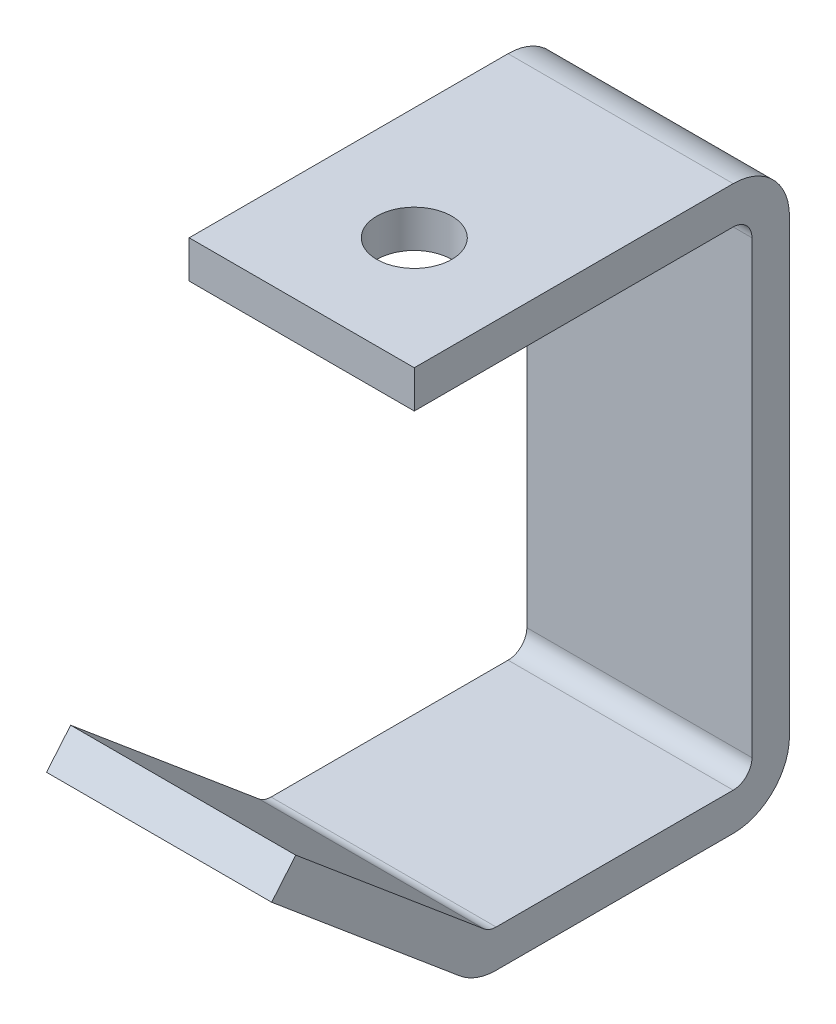
ISO-10303-21;
HEADER;
FILE_DESCRIPTION(('STEP AP214'),'2;1');
FILE_NAME('part.step','',(''),(''),'','','');
FILE_SCHEMA(('AUTOMOTIVE_DESIGN { 1 0 10303 214 1 1 1 1 }'));
ENDSEC;
DATA;
#1=APPLICATION_CONTEXT('core data for automotive mechanical design processes');
#2=APPLICATION_PROTOCOL_DEFINITION('international standard','automotive_design',2000,#1);
#3=PRODUCT_CONTEXT('',#1,'mechanical');
#4=PRODUCT('Part','Part','',(#3));
#5=PRODUCT_RELATED_PRODUCT_CATEGORY('part','',(#4));
#6=PRODUCT_DEFINITION_FORMATION('','',#4);
#7=PRODUCT_DEFINITION_CONTEXT('part definition',#1,'design');
#8=PRODUCT_DEFINITION('design','',#6,#7);
#9=PRODUCT_DEFINITION_SHAPE('','',#8);
#10=(LENGTH_UNIT() NAMED_UNIT(*) SI_UNIT(.MILLI.,.METRE.));
#11=(NAMED_UNIT(*) PLANE_ANGLE_UNIT() SI_UNIT($,.RADIAN.));
#12=(NAMED_UNIT(*) SI_UNIT($,.STERADIAN.) SOLID_ANGLE_UNIT());
#13=UNCERTAINTY_MEASURE_WITH_UNIT(LENGTH_MEASURE(1.E-05),#10,'distance_accuracy_value','');
#14=(GEOMETRIC_REPRESENTATION_CONTEXT(3) GLOBAL_UNCERTAINTY_ASSIGNED_CONTEXT((#13)) GLOBAL_UNIT_ASSIGNED_CONTEXT((#10,
#11,#12)) REPRESENTATION_CONTEXT('',''));
#15=CARTESIAN_POINT('',(0.,0.,0.));
#16=DIRECTION('',(0.,0.,1.));
#17=DIRECTION('',(1.,0.,0.));
#18=AXIS2_PLACEMENT_3D('',#15,#16,#17);
#19=CARTESIAN_POINT('',(19.05,82.55,57.15));
#20=DIRECTION('',(0.,0.,-1.));
#21=DIRECTION('',(0.,1.,0.));
#22=AXIS2_PLACEMENT_3D('',#19,#20,#21);
#23=PLANE('',#22);
#24=DIRECTION('',(-1.,0.,0.));
#25=VECTOR('',#24,1.);
#26=CARTESIAN_POINT('',(19.05,82.55,57.15));
#27=LINE('',#26,#25);
#28=CARTESIAN_POINT('',(19.05,82.55,57.15));
#29=VERTEX_POINT('',#28);
#30=CARTESIAN_POINT('',(-19.05,82.55,57.15));
#31=VERTEX_POINT('',#30);
#32=EDGE_CURVE('E173',#29,#31,#27,.T.);
#33=ORIENTED_EDGE('',*,*,#32,.F.);
#34=DIRECTION('',(0.,-1.,0.));
#35=VECTOR('',#34,1.);
#36=CARTESIAN_POINT('',(19.05,82.55,57.15));
#37=LINE('',#36,#35);
#38=CARTESIAN_POINT('',(19.05,88.9,57.15));
#39=VERTEX_POINT('',#38);
#40=EDGE_CURVE('E191',#39,#29,#37,.T.);
#41=ORIENTED_EDGE('',*,*,#40,.F.);
#42=DIRECTION('',(-1.,0.,0.));
#43=VECTOR('',#42,1.);
#44=CARTESIAN_POINT('',(19.05,88.9,57.15));
#45=LINE('',#44,#43);
#46=CARTESIAN_POINT('',(-19.05,88.9,57.15));
#47=VERTEX_POINT('',#46);
#48=EDGE_CURVE('E203',#39,#47,#45,.T.);
#49=ORIENTED_EDGE('',*,*,#48,.T.);
#50=DIRECTION('',(0.,-1.,0.));
#51=VECTOR('',#50,1.);
#52=CARTESIAN_POINT('',(-19.05,82.55,57.15));
#53=LINE('',#52,#51);
#54=EDGE_CURVE('E181',#47,#31,#53,.T.);
#55=ORIENTED_EDGE('',*,*,#54,.T.);
#56=EDGE_LOOP('',(#33,#41,#49,#55));
#57=FACE_BOUND('',#56,.T.);
#58=ADVANCED_FACE('F38',(#57),#23,.F.);
#59=CARTESIAN_POINT('',(19.05,27.488043347538,77.2089744128137));
#60=DIRECTION('',(0.,0.64278760968654,0.766044443118977));
#61=DIRECTION('',(0.,-0.766044443118977,0.64278760968654));
#62=AXIS2_PLACEMENT_3D('',#59,#60,#61);
#63=PLANE('',#62);
#64=DIRECTION('',(0.,0.766044443118977,-0.64278760968654));
#65=VECTOR('',#64,1.);
#66=CARTESIAN_POINT('',(19.05,27.488043347538,77.2089744128137));
#67=LINE('',#66,#65);
#68=CARTESIAN_POINT('',(19.05,22.6236611337325,81.2906757343232));
#69=VERTEX_POINT('',#68);
#70=CARTESIAN_POINT('',(19.05,27.488043347538,77.2089744128137));
#71=VERTEX_POINT('',#70);
#72=EDGE_CURVE('E172',#69,#71,#67,.T.);
#73=ORIENTED_EDGE('',*,*,#72,.T.);
#74=DIRECTION('',(-1.,0.,0.));
#75=VECTOR('',#74,1.);
#76=CARTESIAN_POINT('',(19.05,27.488043347538,77.2089744128137));
#77=LINE('',#76,#75);
#78=CARTESIAN_POINT('',(-19.05,27.488043347538,77.2089744128137));
#79=VERTEX_POINT('',#78);
#80=EDGE_CURVE('E157',#71,#79,#77,.T.);
#81=ORIENTED_EDGE('',*,*,#80,.T.);
#82=DIRECTION('',(0.,0.766044443118977,-0.64278760968654));
#83=VECTOR('',#82,1.);
#84=CARTESIAN_POINT('',(-19.05,27.488043347538,77.2089744128137));
#85=LINE('',#84,#83);
#86=CARTESIAN_POINT('',(-19.05,22.6236611337325,81.2906757343232));
#87=VERTEX_POINT('',#86);
#88=EDGE_CURVE('E170',#87,#79,#85,.T.);
#89=ORIENTED_EDGE('',*,*,#88,.F.);
#90=DIRECTION('',(-1.,0.,0.));
#91=VECTOR('',#90,1.);
#92=CARTESIAN_POINT('',(19.05,22.6236611337325,81.2906757343232));
#93=LINE('',#92,#91);
#94=EDGE_CURVE('E201',#69,#87,#93,.T.);
#95=ORIENTED_EDGE('',*,*,#94,.F.);
#96=EDGE_LOOP('',(#73,#81,#89,#95));
#97=FACE_BOUND('',#96,.T.);
#98=ADVANCED_FACE('F169',(#97),#63,.T.);
#99=CARTESIAN_POINT('',(19.05,0.,0.));
#100=DIRECTION('',(1.,0.,0.));
#101=DIRECTION('',(0.,0.,-1.));
#102=AXIS2_PLACEMENT_3D('',#99,#100,#101);
#103=PLANE('',#102);
#104=DIRECTION('',(0.,-0.64278760968654,-0.766044443118977));
#105=VECTOR('',#104,1.);
#106=CARTESIAN_POINT('',(19.05,22.6236611337325,81.2906757343232));
#107=LINE('',#106,#105);
#108=CARTESIAN_POINT('',(19.05,-4.12157332070826,49.4169464884691));
#109=VERTEX_POINT('',#108);
#110=EDGE_CURVE('E192',#69,#109,#107,.T.);
#111=ORIENTED_EDGE('',*,*,#110,.T.);
#112=CARTESIAN_POINT('',(19.05,3.175,43.2943945062048));
#113=DIRECTION('',(1.,0.,0.));
#114=DIRECTION('',(0.,0.,-1.));
#115=AXIS2_PLACEMENT_3D('',#112,#113,#114);
#116=CIRCLE('',#115,9.525);
#117=CARTESIAN_POINT('',(19.05,-6.35,43.2943945062048));
#118=VERTEX_POINT('',#117);
#119=EDGE_CURVE('E254',#109,#118,#116,.T.);
#120=ORIENTED_EDGE('',*,*,#119,.T.);
#121=DIRECTION('',(0.,0.,-1.));
#122=VECTOR('',#121,1.);
#123=CARTESIAN_POINT('',(19.05,-6.35,44.45));
#124=LINE('',#123,#122);
#125=CARTESIAN_POINT('',(19.05,-6.35,3.175));
#126=VERTEX_POINT('',#125);
#127=EDGE_CURVE('E206',#118,#126,#124,.T.);
#128=ORIENTED_EDGE('',*,*,#127,.T.);
#129=CARTESIAN_POINT('',(19.05,3.17500000000001,3.175));
#130=DIRECTION('',(1.,0.,0.));
#131=DIRECTION('',(0.,0.,-1.));
#132=AXIS2_PLACEMENT_3D('',#129,#130,#131);
#133=CIRCLE('',#132,9.525);
#134=CARTESIAN_POINT('',(19.05,3.17500000000001,-6.35));
#135=VERTEX_POINT('',#134);
#136=EDGE_CURVE('E59',#126,#135,#133,.T.);
#137=ORIENTED_EDGE('',*,*,#136,.T.);
#138=DIRECTION('',(0.,-1.,0.));
#139=VECTOR('',#138,1.);
#140=CARTESIAN_POINT('',(19.05,82.55,-6.35));
#141=LINE('',#140,#139);
#142=CARTESIAN_POINT('',(19.05,79.375,-6.35));
#143=VERTEX_POINT('',#142);
#144=EDGE_CURVE('E208',#143,#135,#141,.T.);
#145=ORIENTED_EDGE('',*,*,#144,.F.);
#146=CARTESIAN_POINT('',(19.05,79.375,3.175));
#147=DIRECTION('',(1.,0.,0.));
#148=DIRECTION('',(0.,0.,-1.));
#149=AXIS2_PLACEMENT_3D('',#146,#147,#148);
#150=CIRCLE('',#149,9.525);
#151=CARTESIAN_POINT('',(19.05,88.9,3.175));
#152=VERTEX_POINT('',#151);
#153=EDGE_CURVE('E53',#143,#152,#150,.T.);
#154=ORIENTED_EDGE('',*,*,#153,.T.);
#155=DIRECTION('',(0.,0.,-1.));
#156=VECTOR('',#155,1.);
#157=CARTESIAN_POINT('',(19.05,88.9,57.15));
#158=LINE('',#157,#156);
#159=EDGE_CURVE('E195',#39,#152,#158,.T.);
#160=ORIENTED_EDGE('',*,*,#159,.F.);
#161=ORIENTED_EDGE('',*,*,#40,.T.);
#162=DIRECTION('',(0.,0.,-1.));
#163=VECTOR('',#162,1.);
#164=CARTESIAN_POINT('',(19.05,82.55,57.15));
#165=LINE('',#164,#163);
#166=CARTESIAN_POINT('',(19.05,82.55,3.175));
#167=VERTEX_POINT('',#166);
#168=EDGE_CURVE('E174',#29,#167,#165,.T.);
#169=ORIENTED_EDGE('',*,*,#168,.T.);
#170=CARTESIAN_POINT('',(19.05,79.375,3.175));
#171=DIRECTION('',(1.,0.,0.));
#172=DIRECTION('',(0.,0.,-1.));
#173=AXIS2_PLACEMENT_3D('',#170,#171,#172);
#174=CIRCLE('',#173,3.175);
#175=CARTESIAN_POINT('',(19.05,79.375,0.));
#176=VERTEX_POINT('',#175);
#177=EDGE_CURVE('E237',#167,#176,#174,.F.);
#178=ORIENTED_EDGE('',*,*,#177,.T.);
#179=DIRECTION('',(0.,-1.,0.));
#180=VECTOR('',#179,1.);
#181=CARTESIAN_POINT('',(19.05,82.55,0.));
#182=LINE('',#181,#180);
#183=CARTESIAN_POINT('',(19.05,3.175,0.));
#184=VERTEX_POINT('',#183);
#185=EDGE_CURVE('E288',#176,#184,#182,.T.);
#186=ORIENTED_EDGE('',*,*,#185,.T.);
#187=CARTESIAN_POINT('',(19.05,3.175,3.175));
#188=DIRECTION('',(1.,0.,0.));
#189=DIRECTION('',(0.,0.,-1.));
#190=AXIS2_PLACEMENT_3D('',#187,#188,#189);
#191=CIRCLE('',#190,3.175);
#192=CARTESIAN_POINT('',(19.05,0.,3.175));
#193=VERTEX_POINT('',#192);
#194=EDGE_CURVE('E233',#184,#193,#191,.F.);
#195=ORIENTED_EDGE('',*,*,#194,.T.);
#196=DIRECTION('',(0.,0.,-1.));
#197=VECTOR('',#196,1.);
#198=CARTESIAN_POINT('',(19.05,0.,44.45));
#199=LINE('',#198,#197);
#200=CARTESIAN_POINT('',(19.05,0.,43.2943945062048));
#201=VERTEX_POINT('',#200);
#202=EDGE_CURVE('E284',#201,#193,#199,.T.);
#203=ORIENTED_EDGE('',*,*,#202,.F.);
#204=CARTESIAN_POINT('',(19.05,3.175,43.2943945062048));
#205=DIRECTION('',(1.,0.,0.));
#206=DIRECTION('',(0.,0.,-1.));
#207=AXIS2_PLACEMENT_3D('',#204,#205,#206);
#208=CIRCLE('',#207,3.175);
#209=CARTESIAN_POINT('',(19.05,0.74280889309725,45.3352451669596));
#210=VERTEX_POINT('',#209);
#211=EDGE_CURVE('E229',#201,#210,#208,.F.);
#212=ORIENTED_EDGE('',*,*,#211,.T.);
#213=DIRECTION('',(0.,-0.64278760968654,-0.766044443118977));
#214=VECTOR('',#213,1.);
#215=CARTESIAN_POINT('',(19.05,27.488043347538,77.2089744128137));
#216=LINE('',#215,#214);
#217=EDGE_CURVE('E282',#71,#210,#216,.T.);
#218=ORIENTED_EDGE('',*,*,#217,.F.);
#219=ORIENTED_EDGE('',*,*,#72,.F.);
#220=EDGE_LOOP('',(#111,#120,#128,#137,#145,#154,#160,#161,#169,#178,#186,#195,#203,#212,#218,#219));
#221=FACE_BOUND('',#220,.T.);
#222=ADVANCED_FACE('F272',(#221),#103,.T.);
#223=CARTESIAN_POINT('',(19.05,82.55,-6.35));
#224=DIRECTION('',(0.,0.,-1.));
#225=DIRECTION('',(0.,1.,0.));
#226=AXIS2_PLACEMENT_3D('',#223,#224,#225);
#227=PLANE('',#226);
#228=ORIENTED_EDGE('',*,*,#144,.T.);
#229=DIRECTION('',(-1.,0.,0.));
#230=VECTOR('',#229,1.);
#231=CARTESIAN_POINT('',(-19.05,3.17500000000001,-6.35));
#232=LINE('',#231,#230);
#233=CARTESIAN_POINT('',(-19.05,3.17500000000001,-6.35));
#234=VERTEX_POINT('',#233);
#235=EDGE_CURVE('E46',#135,#234,#232,.T.);
#236=ORIENTED_EDGE('',*,*,#235,.T.);
#237=DIRECTION('',(0.,-1.,0.));
#238=VECTOR('',#237,1.);
#239=CARTESIAN_POINT('',(-19.05,82.55,-6.35));
#240=LINE('',#239,#238);
#241=CARTESIAN_POINT('',(-19.05,79.375,-6.35));
#242=VERTEX_POINT('',#241);
#243=EDGE_CURVE('E196',#242,#234,#240,.T.);
#244=ORIENTED_EDGE('',*,*,#243,.F.);
#245=DIRECTION('',(-1.,0.,0.));
#246=VECTOR('',#245,1.);
#247=CARTESIAN_POINT('',(19.05,79.375,-6.35));
#248=LINE('',#247,#246);
#249=EDGE_CURVE('E256',#242,#143,#248,.F.);
#250=ORIENTED_EDGE('',*,*,#249,.T.);
#251=EDGE_LOOP('',(#228,#236,#244,#250));
#252=FACE_BOUND('',#251,.T.);
#253=ADVANCED_FACE('F261',(#252),#227,.T.);
#254=CARTESIAN_POINT('',(19.05,88.9,57.15));
#255=DIRECTION('',(0.,1.,0.));
#256=DIRECTION('',(0.,0.,1.));
#257=AXIS2_PLACEMENT_3D('',#254,#255,#256);
#258=PLANE('',#257);
#259=CARTESIAN_POINT('',(0.,88.9,38.1));
#260=DIRECTION('',(0.,1.,0.));
#261=DIRECTION('',(0.,0.,1.));
#262=AXIS2_PLACEMENT_3D('',#259,#260,#261);
#263=CIRCLE('',#262,6.35);
#264=CARTESIAN_POINT('',(0.,88.9,44.45));
#265=VERTEX_POINT('',#264);
#266=EDGE_CURVE('E299',#265,#265,#263,.T.);
#267=ORIENTED_EDGE('',*,*,#266,.F.);
#268=EDGE_LOOP('',(#267));
#269=FACE_BOUND('',#268,.T.);
#270=ORIENTED_EDGE('',*,*,#159,.T.);
#271=DIRECTION('',(-1.,0.,0.));
#272=VECTOR('',#271,1.);
#273=CARTESIAN_POINT('',(19.05,88.9,3.175));
#274=LINE('',#273,#272);
#275=CARTESIAN_POINT('',(-19.05,88.9,3.175));
#276=VERTEX_POINT('',#275);
#277=EDGE_CURVE('E11',#152,#276,#274,.T.);
#278=ORIENTED_EDGE('',*,*,#277,.T.);
#279=DIRECTION('',(0.,0.,-1.));
#280=VECTOR('',#279,1.);
#281=CARTESIAN_POINT('',(-19.05,88.9,57.15));
#282=LINE('',#281,#280);
#283=EDGE_CURVE('E184',#47,#276,#282,.T.);
#284=ORIENTED_EDGE('',*,*,#283,.F.);
#285=ORIENTED_EDGE('',*,*,#48,.F.);
#286=EDGE_LOOP('',(#270,#278,#284,#285));
#287=FACE_BOUND('',#286,.T.);
#288=ADVANCED_FACE('F270',(#269,#287),#258,.T.);
#289=CARTESIAN_POINT('',(19.05,22.6236611337325,81.2906757343232));
#290=DIRECTION('',(0.,0.766044443118977,-0.642787609686541));
#291=DIRECTION('',(0.,0.64278760968654,0.766044443118977));
#292=AXIS2_PLACEMENT_3D('',#289,#290,#291);
#293=PLANE('',#292);
#294=DIRECTION('',(0.,-0.64278760968654,-0.766044443118977));
#295=VECTOR('',#294,1.);
#296=CARTESIAN_POINT('',(-19.05,22.6236611337325,81.2906757343232));
#297=LINE('',#296,#295);
#298=CARTESIAN_POINT('',(-19.05,-4.12157332070826,49.4169464884691));
#299=VERTEX_POINT('',#298);
#300=EDGE_CURVE('E180',#87,#299,#297,.T.);
#301=ORIENTED_EDGE('',*,*,#300,.T.);
#302=DIRECTION('',(-1.,0.,0.));
#303=VECTOR('',#302,1.);
#304=CARTESIAN_POINT('',(19.05,-4.12157332070826,49.4169464884691));
#305=LINE('',#304,#303);
#306=EDGE_CURVE('E250',#299,#109,#305,.F.);
#307=ORIENTED_EDGE('',*,*,#306,.T.);
#308=ORIENTED_EDGE('',*,*,#110,.F.);
#309=ORIENTED_EDGE('',*,*,#94,.T.);
#310=EDGE_LOOP('',(#301,#307,#308,#309));
#311=FACE_BOUND('',#310,.T.);
#312=ADVANCED_FACE('F341',(#311),#293,.F.);
#313=CARTESIAN_POINT('',(19.05,-6.35,44.45));
#314=DIRECTION('',(0.,1.,0.));
#315=DIRECTION('',(0.,0.,1.));
#316=AXIS2_PLACEMENT_3D('',#313,#314,#315);
#317=PLANE('',#316);
#318=ORIENTED_EDGE('',*,*,#127,.F.);
#319=DIRECTION('',(-1.,0.,0.));
#320=VECTOR('',#319,1.);
#321=CARTESIAN_POINT('',(19.05,-6.35,43.2943945062048));
#322=LINE('',#321,#320);
#323=CARTESIAN_POINT('',(-19.05,-6.35,43.2943945062048));
#324=VERTEX_POINT('',#323);
#325=EDGE_CURVE('E241',#118,#324,#322,.T.);
#326=ORIENTED_EDGE('',*,*,#325,.T.);
#327=DIRECTION('',(0.,0.,-1.));
#328=VECTOR('',#327,1.);
#329=CARTESIAN_POINT('',(-19.05,-6.35,44.45));
#330=LINE('',#329,#328);
#331=CARTESIAN_POINT('',(-19.05,-6.35,3.175));
#332=VERTEX_POINT('',#331);
#333=EDGE_CURVE('E186',#324,#332,#330,.T.);
#334=ORIENTED_EDGE('',*,*,#333,.T.);
#335=DIRECTION('',(-1.,0.,0.));
#336=VECTOR('',#335,1.);
#337=CARTESIAN_POINT('',(19.05,-6.35,3.175));
#338=LINE('',#337,#336);
#339=EDGE_CURVE('E239',#332,#126,#338,.F.);
#340=ORIENTED_EDGE('',*,*,#339,.T.);
#341=EDGE_LOOP('',(#318,#326,#334,#340));
#342=FACE_BOUND('',#341,.T.);
#343=ADVANCED_FACE('F40',(#342),#317,.F.);
#344=CARTESIAN_POINT('',(-19.05,0.,0.));
#345=DIRECTION('',(1.,0.,0.));
#346=DIRECTION('',(0.,0.,-1.));
#347=AXIS2_PLACEMENT_3D('',#344,#345,#346);
#348=PLANE('',#347);
#349=ORIENTED_EDGE('',*,*,#333,.F.);
#350=CARTESIAN_POINT('',(-19.05,3.175,43.2943945062048));
#351=DIRECTION('',(1.,0.,0.));
#352=DIRECTION('',(0.,0.,-1.));
#353=AXIS2_PLACEMENT_3D('',#350,#351,#352);
#354=CIRCLE('',#353,9.525);
#355=EDGE_CURVE('E248',#324,#299,#354,.F.);
#356=ORIENTED_EDGE('',*,*,#355,.T.);
#357=ORIENTED_EDGE('',*,*,#300,.F.);
#358=ORIENTED_EDGE('',*,*,#88,.T.);
#359=DIRECTION('',(0.,-0.64278760968654,-0.766044443118977));
#360=VECTOR('',#359,1.);
#361=CARTESIAN_POINT('',(-19.05,27.488043347538,77.2089744128137));
#362=LINE('',#361,#360);
#363=CARTESIAN_POINT('',(-19.05,0.74280889309725,45.3352451669596));
#364=VERTEX_POINT('',#363);
#365=EDGE_CURVE('E153',#79,#364,#362,.T.);
#366=ORIENTED_EDGE('',*,*,#365,.T.);
#367=CARTESIAN_POINT('',(-19.05,3.175,43.2943945062048));
#368=DIRECTION('',(1.,0.,0.));
#369=DIRECTION('',(0.,0.,-1.));
#370=AXIS2_PLACEMENT_3D('',#367,#368,#369);
#371=CIRCLE('',#370,3.175);
#372=CARTESIAN_POINT('',(-19.05,0.,43.2943945062048));
#373=VERTEX_POINT('',#372);
#374=EDGE_CURVE('E227',#364,#373,#371,.T.);
#375=ORIENTED_EDGE('',*,*,#374,.T.);
#376=DIRECTION('',(0.,0.,-1.));
#377=VECTOR('',#376,1.);
#378=CARTESIAN_POINT('',(-19.05,0.,44.45));
#379=LINE('',#378,#377);
#380=CARTESIAN_POINT('',(-19.05,0.,3.175));
#381=VERTEX_POINT('',#380);
#382=EDGE_CURVE('E164',#373,#381,#379,.T.);
#383=ORIENTED_EDGE('',*,*,#382,.T.);
#384=CARTESIAN_POINT('',(-19.05,3.175,3.175));
#385=DIRECTION('',(1.,0.,0.));
#386=DIRECTION('',(0.,0.,-1.));
#387=AXIS2_PLACEMENT_3D('',#384,#385,#386);
#388=CIRCLE('',#387,3.175);
#389=CARTESIAN_POINT('',(-19.05,3.175,0.));
#390=VERTEX_POINT('',#389);
#391=EDGE_CURVE('E231',#381,#390,#388,.T.);
#392=ORIENTED_EDGE('',*,*,#391,.T.);
#393=DIRECTION('',(0.,-1.,0.));
#394=VECTOR('',#393,1.);
#395=CARTESIAN_POINT('',(-19.05,82.55,0.));
#396=LINE('',#395,#394);
#397=CARTESIAN_POINT('',(-19.05,79.375,0.));
#398=VERTEX_POINT('',#397);
#399=EDGE_CURVE('E295',#398,#390,#396,.T.);
#400=ORIENTED_EDGE('',*,*,#399,.F.);
#401=CARTESIAN_POINT('',(-19.05,79.375,3.175));
#402=DIRECTION('',(1.,0.,0.));
#403=DIRECTION('',(0.,0.,-1.));
#404=AXIS2_PLACEMENT_3D('',#401,#402,#403);
#405=CIRCLE('',#404,3.175);
#406=CARTESIAN_POINT('',(-19.05,82.55,3.175));
#407=VERTEX_POINT('',#406);
#408=EDGE_CURVE('E235',#398,#407,#405,.T.);
#409=ORIENTED_EDGE('',*,*,#408,.T.);
#410=DIRECTION('',(0.,0.,-1.));
#411=VECTOR('',#410,1.);
#412=CARTESIAN_POINT('',(-19.05,82.55,57.15));
#413=LINE('',#412,#411);
#414=EDGE_CURVE('E163',#31,#407,#413,.T.);
#415=ORIENTED_EDGE('',*,*,#414,.F.);
#416=ORIENTED_EDGE('',*,*,#54,.F.);
#417=ORIENTED_EDGE('',*,*,#283,.T.);
#418=CARTESIAN_POINT('',(-19.05,79.375,3.175));
#419=DIRECTION('',(1.,0.,0.));
#420=DIRECTION('',(0.,0.,-1.));
#421=AXIS2_PLACEMENT_3D('',#418,#419,#420);
#422=CIRCLE('',#421,9.525);
#423=EDGE_CURVE('E244',#276,#242,#422,.F.);
#424=ORIENTED_EDGE('',*,*,#423,.T.);
#425=ORIENTED_EDGE('',*,*,#243,.T.);
#426=CARTESIAN_POINT('',(-19.05,3.17500000000001,3.175));
#427=DIRECTION('',(1.,0.,0.));
#428=DIRECTION('',(0.,0.,-1.));
#429=AXIS2_PLACEMENT_3D('',#426,#427,#428);
#430=CIRCLE('',#429,9.525);
#431=EDGE_CURVE('E246',#234,#332,#430,.F.);
#432=ORIENTED_EDGE('',*,*,#431,.T.);
#433=EDGE_LOOP('',(#349,#356,#357,#358,#366,#375,#383,#392,#400,#409,#415,#416,#417,#424,#425,#432));
#434=FACE_BOUND('',#433,.T.);
#435=ADVANCED_FACE('F178',(#434),#348,.F.);
#436=CARTESIAN_POINT('',(19.05,82.55,0.));
#437=DIRECTION('',(0.,0.,-1.));
#438=DIRECTION('',(0.,1.,0.));
#439=AXIS2_PLACEMENT_3D('',#436,#437,#438);
#440=PLANE('',#439);
#441=ORIENTED_EDGE('',*,*,#399,.T.);
#442=DIRECTION('',(-1.,0.,0.));
#443=VECTOR('',#442,1.);
#444=CARTESIAN_POINT('',(19.05,3.175,0.));
#445=LINE('',#444,#443);
#446=EDGE_CURVE('E223',#390,#184,#445,.F.);
#447=ORIENTED_EDGE('',*,*,#446,.T.);
#448=ORIENTED_EDGE('',*,*,#185,.F.);
#449=DIRECTION('',(-1.,0.,0.));
#450=VECTOR('',#449,1.);
#451=CARTESIAN_POINT('',(-19.05,79.375,0.));
#452=LINE('',#451,#450);
#453=EDGE_CURVE('E220',#176,#398,#452,.T.);
#454=ORIENTED_EDGE('',*,*,#453,.T.);
#455=EDGE_LOOP('',(#441,#447,#448,#454));
#456=FACE_BOUND('',#455,.T.);
#457=ADVANCED_FACE('F309',(#456),#440,.F.);
#458=CARTESIAN_POINT('',(19.05,82.55,57.15));
#459=DIRECTION('',(0.,1.,0.));
#460=DIRECTION('',(0.,0.,1.));
#461=AXIS2_PLACEMENT_3D('',#458,#459,#460);
#462=PLANE('',#461);
#463=CARTESIAN_POINT('',(0.,82.55,38.1));
#464=DIRECTION('',(0.,1.,0.));
#465=DIRECTION('',(0.,0.,1.));
#466=AXIS2_PLACEMENT_3D('',#463,#464,#465);
#467=CIRCLE('',#466,6.35);
#468=CARTESIAN_POINT('',(0.,82.55,44.45));
#469=VERTEX_POINT('',#468);
#470=EDGE_CURVE('E298',#469,#469,#467,.F.);
#471=ORIENTED_EDGE('',*,*,#470,.F.);
#472=EDGE_LOOP('',(#471));
#473=FACE_BOUND('',#472,.T.);
#474=ORIENTED_EDGE('',*,*,#414,.T.);
#475=DIRECTION('',(-1.,0.,0.));
#476=VECTOR('',#475,1.);
#477=CARTESIAN_POINT('',(19.05,82.55,3.175));
#478=LINE('',#477,#476);
#479=EDGE_CURVE('E225',#407,#167,#478,.F.);
#480=ORIENTED_EDGE('',*,*,#479,.T.);
#481=ORIENTED_EDGE('',*,*,#168,.F.);
#482=ORIENTED_EDGE('',*,*,#32,.T.);
#483=EDGE_LOOP('',(#474,#480,#481,#482));
#484=FACE_BOUND('',#483,.T.);
#485=ADVANCED_FACE('F307',(#473,#484),#462,.F.);
#486=CARTESIAN_POINT('',(19.05,27.488043347538,77.2089744128137));
#487=DIRECTION('',(0.,0.766044443118977,-0.642787609686541));
#488=DIRECTION('',(0.,0.64278760968654,0.766044443118977));
#489=AXIS2_PLACEMENT_3D('',#486,#487,#488);
#490=PLANE('',#489);
#491=ORIENTED_EDGE('',*,*,#217,.T.);
#492=DIRECTION('',(-1.,0.,0.));
#493=VECTOR('',#492,1.);
#494=CARTESIAN_POINT('',(-19.05,0.742808893097247,45.3352451669596));
#495=LINE('',#494,#493);
#496=EDGE_CURVE('E160',#210,#364,#495,.T.);
#497=ORIENTED_EDGE('',*,*,#496,.T.);
#498=ORIENTED_EDGE('',*,*,#365,.F.);
#499=ORIENTED_EDGE('',*,*,#80,.F.);
#500=EDGE_LOOP('',(#491,#497,#498,#499));
#501=FACE_BOUND('',#500,.T.);
#502=ADVANCED_FACE('F156',(#501),#490,.T.);
#503=CARTESIAN_POINT('',(19.05,0.,44.45));
#504=DIRECTION('',(0.,1.,0.));
#505=DIRECTION('',(0.,0.,1.));
#506=AXIS2_PLACEMENT_3D('',#503,#504,#505);
#507=PLANE('',#506);
#508=ORIENTED_EDGE('',*,*,#382,.F.);
#509=DIRECTION('',(-1.,0.,0.));
#510=VECTOR('',#509,1.);
#511=CARTESIAN_POINT('',(19.05,0.,43.2943945062048));
#512=LINE('',#511,#510);
#513=EDGE_CURVE('E218',#373,#201,#512,.F.);
#514=ORIENTED_EDGE('',*,*,#513,.T.);
#515=ORIENTED_EDGE('',*,*,#202,.T.);
#516=DIRECTION('',(-1.,0.,0.));
#517=VECTOR('',#516,1.);
#518=CARTESIAN_POINT('',(19.05,0.,3.175));
#519=LINE('',#518,#517);
#520=EDGE_CURVE('E215',#193,#381,#519,.T.);
#521=ORIENTED_EDGE('',*,*,#520,.T.);
#522=EDGE_LOOP('',(#508,#514,#515,#521));
#523=FACE_BOUND('',#522,.T.);
#524=ADVANCED_FACE('F327',(#523),#507,.T.);
#525=CARTESIAN_POINT('',(19.05,3.175,43.2943945062048));
#526=DIRECTION('',(1.,0.,0.));
#527=DIRECTION('',(0.,0.,-1.));
#528=AXIS2_PLACEMENT_3D('',#525,#526,#527);
#529=CYLINDRICAL_SURFACE('',#528,3.175);
#530=ORIENTED_EDGE('',*,*,#211,.F.);
#531=ORIENTED_EDGE('',*,*,#513,.F.);
#532=ORIENTED_EDGE('',*,*,#374,.F.);
#533=ORIENTED_EDGE('',*,*,#496,.F.);
#534=EDGE_LOOP('',(#530,#531,#532,#533));
#535=FACE_BOUND('',#534,.T.);
#536=ADVANCED_FACE('F330',(#535),#529,.F.);
#537=CARTESIAN_POINT('',(19.05,3.175,3.175));
#538=DIRECTION('',(-1.,0.,0.));
#539=DIRECTION('',(0.,0.,1.));
#540=AXIS2_PLACEMENT_3D('',#537,#538,#539);
#541=CYLINDRICAL_SURFACE('',#540,3.175);
#542=ORIENTED_EDGE('',*,*,#194,.F.);
#543=ORIENTED_EDGE('',*,*,#446,.F.);
#544=ORIENTED_EDGE('',*,*,#391,.F.);
#545=ORIENTED_EDGE('',*,*,#520,.F.);
#546=EDGE_LOOP('',(#542,#543,#544,#545));
#547=FACE_BOUND('',#546,.T.);
#548=ADVANCED_FACE('F321',(#547),#541,.F.);
#549=CARTESIAN_POINT('',(19.05,79.375,3.175));
#550=DIRECTION('',(1.,0.,0.));
#551=DIRECTION('',(0.,0.,-1.));
#552=AXIS2_PLACEMENT_3D('',#549,#550,#551);
#553=CYLINDRICAL_SURFACE('',#552,3.175);
#554=ORIENTED_EDGE('',*,*,#177,.F.);
#555=ORIENTED_EDGE('',*,*,#479,.F.);
#556=ORIENTED_EDGE('',*,*,#408,.F.);
#557=ORIENTED_EDGE('',*,*,#453,.F.);
#558=EDGE_LOOP('',(#554,#555,#556,#557));
#559=FACE_BOUND('',#558,.T.);
#560=ADVANCED_FACE('F313',(#559),#553,.F.);
#561=CARTESIAN_POINT('',(19.05,3.175,43.2943945062048));
#562=DIRECTION('',(-1.,0.,0.));
#563=DIRECTION('',(0.,0.,1.));
#564=AXIS2_PLACEMENT_3D('',#561,#562,#563);
#565=CYLINDRICAL_SURFACE('',#564,9.525);
#566=ORIENTED_EDGE('',*,*,#119,.F.);
#567=ORIENTED_EDGE('',*,*,#306,.F.);
#568=ORIENTED_EDGE('',*,*,#355,.F.);
#569=ORIENTED_EDGE('',*,*,#325,.F.);
#570=EDGE_LOOP('',(#566,#567,#568,#569));
#571=FACE_BOUND('',#570,.T.);
#572=ADVANCED_FACE('F338',(#571),#565,.T.);
#573=CARTESIAN_POINT('',(19.05,3.17500000000001,3.175));
#574=DIRECTION('',(1.,0.,0.));
#575=DIRECTION('',(0.,0.,-1.));
#576=AXIS2_PLACEMENT_3D('',#573,#574,#575);
#577=CYLINDRICAL_SURFACE('',#576,9.525);
#578=ORIENTED_EDGE('',*,*,#136,.F.);
#579=ORIENTED_EDGE('',*,*,#339,.F.);
#580=ORIENTED_EDGE('',*,*,#431,.F.);
#581=ORIENTED_EDGE('',*,*,#235,.F.);
#582=EDGE_LOOP('',(#578,#579,#580,#581));
#583=FACE_BOUND('',#582,.T.);
#584=ADVANCED_FACE('F436',(#583),#577,.T.);
#585=CARTESIAN_POINT('',(19.05,79.375,3.175));
#586=DIRECTION('',(-1.,0.,0.));
#587=DIRECTION('',(0.,0.,1.));
#588=AXIS2_PLACEMENT_3D('',#585,#586,#587);
#589=CYLINDRICAL_SURFACE('',#588,9.525);
#590=ORIENTED_EDGE('',*,*,#153,.F.);
#591=ORIENTED_EDGE('',*,*,#249,.F.);
#592=ORIENTED_EDGE('',*,*,#423,.F.);
#593=ORIENTED_EDGE('',*,*,#277,.F.);
#594=EDGE_LOOP('',(#590,#591,#592,#593));
#595=FACE_BOUND('',#594,.T.);
#596=ADVANCED_FACE('F268',(#595),#589,.T.);
#597=CARTESIAN_POINT('',(0.,-6.351,38.1));
#598=DIRECTION('',(0.,1.,0.));
#599=DIRECTION('',(0.,0.,1.));
#600=AXIS2_PLACEMENT_3D('',#597,#598,#599);
#601=CYLINDRICAL_SURFACE('',#600,6.35);
#602=ORIENTED_EDGE('',*,*,#266,.T.);
#603=EDGE_LOOP('',(#602));
#604=FACE_BOUND('',#603,.T.);
#605=ORIENTED_EDGE('',*,*,#470,.T.);
#606=EDGE_LOOP('',(#605));
#607=FACE_BOUND('',#606,.T.);
#608=ADVANCED_FACE('F305',(#604,#607),#601,.F.);
#609=CLOSED_SHELL('',(#58,#98,#222,#253,#288,#312,#343,#435,#457,#485,#502,#524,#536,#548,#560,
#572,#584,#596,#608));
#610=MANIFOLD_SOLID_BREP('B2',#609);
#611=ADVANCED_BREP_SHAPE_REPRESENTATION('',(#18,#610),#14);
#612=SHAPE_DEFINITION_REPRESENTATION(#9,#611);
ENDSEC;
END-ISO-10303-21;
